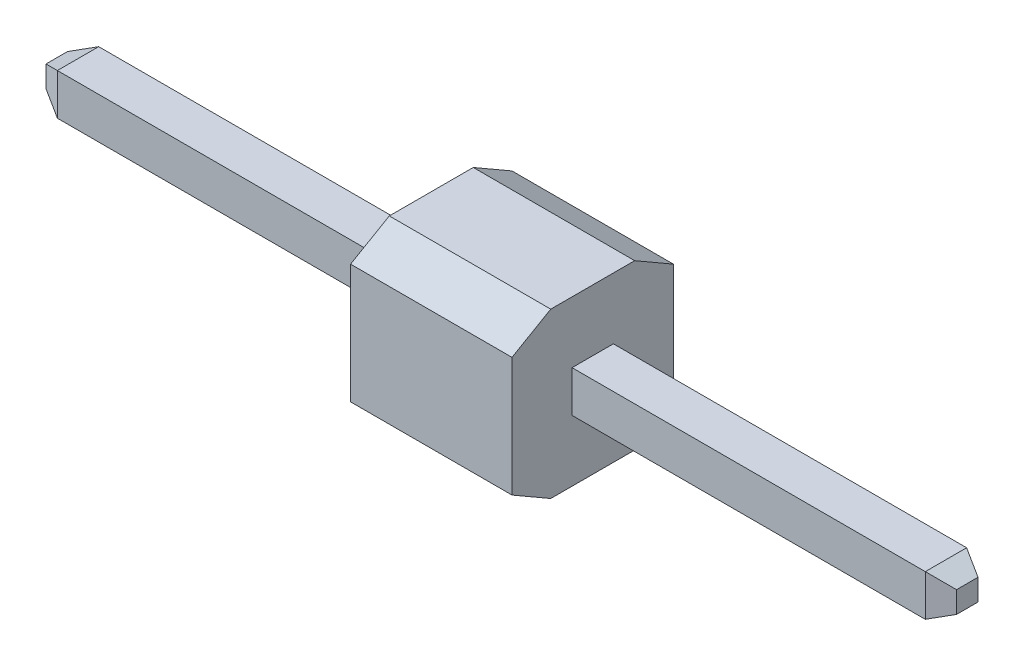
ISO-10303-21;
HEADER;
FILE_DESCRIPTION(('STEP AP214'),'2;1');
FILE_NAME('part.step','',(''),(''),'','','');
FILE_SCHEMA(('AUTOMOTIVE_DESIGN { 1 0 10303 214 1 1 1 1 }'));
ENDSEC;
DATA;
#1=APPLICATION_CONTEXT('core data for automotive mechanical design processes');
#2=APPLICATION_PROTOCOL_DEFINITION('international standard','automotive_design',2000,#1);
#3=PRODUCT_CONTEXT('',#1,'mechanical');
#4=PRODUCT('Part','Part','',(#3));
#5=PRODUCT_RELATED_PRODUCT_CATEGORY('part','',(#4));
#6=PRODUCT_DEFINITION_FORMATION('','',#4);
#7=PRODUCT_DEFINITION_CONTEXT('part definition',#1,'design');
#8=PRODUCT_DEFINITION('design','',#6,#7);
#9=PRODUCT_DEFINITION_SHAPE('','',#8);
#10=(LENGTH_UNIT() NAMED_UNIT(*) SI_UNIT(.MILLI.,.METRE.));
#11=(NAMED_UNIT(*) PLANE_ANGLE_UNIT() SI_UNIT($,.RADIAN.));
#12=(NAMED_UNIT(*) SI_UNIT($,.STERADIAN.) SOLID_ANGLE_UNIT());
#13=UNCERTAINTY_MEASURE_WITH_UNIT(LENGTH_MEASURE(1.E-05),#10,'distance_accuracy_value','');
#14=(GEOMETRIC_REPRESENTATION_CONTEXT(3) GLOBAL_UNCERTAINTY_ASSIGNED_CONTEXT((#13)) GLOBAL_UNIT_ASSIGNED_CONTEXT((#10,
#11,#12)) REPRESENTATION_CONTEXT('',''));
#15=CARTESIAN_POINT('',(0.,0.,0.));
#16=DIRECTION('',(0.,0.,1.));
#17=DIRECTION('',(1.,0.,0.));
#18=AXIS2_PLACEMENT_3D('',#15,#16,#17);
#19=CARTESIAN_POINT('',(5.42105136128053,5.39712144810304,-2.62999869851647));
#20=DIRECTION('',(1.,-9.93476518829084E-08,4.37113882867379E-08));
#21=DIRECTION('',(-9.93476589883358E-08,-1.,8.74227765734759E-08));
#22=AXIS2_PLACEMENT_3D('',#19,#20,#21);
#23=PLANE('',#22);
#24=DIRECTION('',(-1.18186619959584E-08,-0.500000075710541,-0.866025360072933));
#25=VECTOR('',#24,1.);
#26=CARTESIAN_POINT('',(5.42105116910592,4.15353174686681,-1.05999858979839));
#27=LINE('',#26,#25);
#28=CARTESIAN_POINT('',(5.42105116910592,4.15353174686681,-1.05999858979839));
#29=VERTEX_POINT('',#28);
#30=CARTESIAN_POINT('',(5.42105116091771,3.80712153290314,-1.65999855951425));
#31=VERTEX_POINT('',#30);
#32=EDGE_CURVE('E11',#29,#31,#27,.T.);
#33=ORIENTED_EDGE('',*,*,#32,.T.);
#34=DIRECTION('',(4.37113811813104E-08,-8.74227814926175E-08,-0.999999999999995));
#35=VECTOR('',#34,1.);
#36=CARTESIAN_POINT('',(5.42105116091771,3.80712153290314,-1.65999855951425));
#37=LINE('',#36,#35);
#38=CARTESIAN_POINT('',(5.42105121774251,3.80712141925352,-2.95999855951425));
#39=VERTEX_POINT('',#38);
#40=EDGE_CURVE('E304',#31,#39,#37,.T.);
#41=ORIENTED_EDGE('',*,*,#40,.T.);
#42=DIRECTION('',(8.75289950712043E-08,0.499999924289839,-0.866025447495711));
#43=VECTOR('',#42,1.);
#44=CARTESIAN_POINT('',(5.42105121774251,3.80712141925352,-2.95999855951425));
#45=LINE('',#44,#43);
#46=CARTESIAN_POINT('',(5.42105127838437,4.15353152830985,-3.55999858979839));
#47=VERTEX_POINT('',#46);
#48=EDGE_CURVE('E296',#39,#47,#45,.T.);
#49=ORIENTED_EDGE('',*,*,#48,.T.);
#50=DIRECTION('',(9.93476593244772E-08,0.999999999999991,-8.74227764822788E-08));
#51=VECTOR('',#50,1.);
#52=CARTESIAN_POINT('',(5.42105127838437,4.15353152830985,-3.55999858979839));
#53=LINE('',#52,#51);
#54=CARTESIAN_POINT('',(5.42105146189735,6.00071120527985,-3.55999875128397));
#55=VERTEX_POINT('',#54);
#56=EDGE_CURVE('E281',#47,#55,#53,.T.);
#57=ORIENTED_EDGE('',*,*,#56,.T.);
#58=DIRECTION('',(-1.18186632778483E-08,-0.500000075710533,-0.866025360072938));
#59=VECTOR('',#58,1.);
#60=CARTESIAN_POINT('',(5.42105147008556,6.34712141925352,-2.9599987815681));
#61=LINE('',#60,#59);
#62=CARTESIAN_POINT('',(5.42105147008556,6.34712141925352,-2.9599987815681));
#63=VERTEX_POINT('',#62);
#64=EDGE_CURVE('E265',#63,#55,#61,.T.);
#65=ORIENTED_EDGE('',*,*,#64,.F.);
#66=DIRECTION('',(4.37113811813104E-08,-8.74227842254741E-08,-0.999999999999995));
#67=VECTOR('',#66,1.);
#68=CARTESIAN_POINT('',(5.42105141326076,6.34712153290314,-1.6599987815681));
#69=LINE('',#68,#67);
#70=CARTESIAN_POINT('',(5.42105141326076,6.34712153290314,-1.6599987815681));
#71=VERTEX_POINT('',#70);
#72=EDGE_CURVE('E248',#71,#63,#69,.T.);
#73=ORIENTED_EDGE('',*,*,#72,.F.);
#74=DIRECTION('',(8.75289963525477E-08,0.499999924289836,-0.866025447495714));
#75=VECTOR('',#74,1.);
#76=CARTESIAN_POINT('',(5.4210513526189,6.00071142383681,-1.05999875128397));
#77=LINE('',#76,#75);
#78=CARTESIAN_POINT('',(5.4210513526189,6.00071142383681,-1.05999875128397));
#79=VERTEX_POINT('',#78);
#80=EDGE_CURVE('E242',#79,#71,#77,.T.);
#81=ORIENTED_EDGE('',*,*,#80,.F.);
#82=DIRECTION('',(9.93476593244772E-08,0.999999999999991,-8.74227763620714E-08));
#83=VECTOR('',#82,1.);
#84=CARTESIAN_POINT('',(5.42105116910592,4.15353174686681,-1.05999858979839));
#85=LINE('',#84,#83);
#86=EDGE_CURVE('E236',#29,#79,#85,.T.);
#87=ORIENTED_EDGE('',*,*,#86,.F.);
#88=EDGE_LOOP('',(#33,#41,#49,#57,#65,#73,#81,#87));
#89=FACE_BOUND('',#88,.T.);
#90=DIRECTION('',(-4.37113817364219E-08,8.74227856773042E-08,0.999999999999995));
#91=VECTOR('',#90,1.);
#92=CARTESIAN_POINT('',(5.42105129769803,4.75712144810304,-2.62999864256589));
#93=LINE('',#92,#91);
#94=CARTESIAN_POINT('',(5.42105129769803,4.75712144810304,-2.62999864256589));
#95=VERTEX_POINT('',#94);
#96=CARTESIAN_POINT('',(5.42105126972274,4.75712150405362,-1.98999864256589));
#97=VERTEX_POINT('',#96);
#98=EDGE_CURVE('E302',#95,#97,#93,.T.);
#99=ORIENTED_EDGE('',*,*,#98,.T.);
#100=DIRECTION('',(-9.93476592658906E-08,-0.999999999999991,8.74227766567418E-08));
#101=VECTOR('',#100,1.);
#102=CARTESIAN_POINT('',(5.42105133330524,5.39712150405362,-1.98999869851647));
#103=LINE('',#102,#101);
#104=CARTESIAN_POINT('',(5.42105133330524,5.39712150405362,-1.98999869851647));
#105=VERTEX_POINT('',#104);
#106=EDGE_CURVE('E293',#105,#97,#103,.T.);
#107=ORIENTED_EDGE('',*,*,#106,.F.);
#108=DIRECTION('',(-4.37113817364219E-08,8.74227856773042E-08,0.999999999999995));
#109=VECTOR('',#108,1.);
#110=CARTESIAN_POINT('',(5.42105136128053,5.39712144810304,-2.62999869851647));
#111=LINE('',#110,#109);
#112=CARTESIAN_POINT('',(5.42105136128053,5.39712144810304,-2.62999869851647));
#113=VERTEX_POINT('',#112);
#114=EDGE_CURVE('E278',#113,#105,#111,.T.);
#115=ORIENTED_EDGE('',*,*,#114,.F.);
#116=DIRECTION('',(-9.93476592658906E-08,-0.999999999999991,8.74227766567418E-08));
#117=VECTOR('',#116,1.);
#118=CARTESIAN_POINT('',(5.42105136128053,5.39712144810304,-2.62999869851647));
#119=LINE('',#118,#117);
#120=EDGE_CURVE('E263',#113,#95,#119,.T.);
#121=ORIENTED_EDGE('',*,*,#120,.T.);
#122=EDGE_LOOP('',(#99,#107,#115,#121));
#123=FACE_BOUND('',#122,.T.);
#124=ADVANCED_FACE('F17',(#89,#123),#23,.T.);
#125=CARTESIAN_POINT('',(2.92105136128053,5.39712169647217,-2.62999880779494));
#126=DIRECTION('',(1.,-9.93476518829084E-08,4.37113882867379E-08));
#127=DIRECTION('',(-9.93476589883358E-08,-1.,8.74227765734759E-08));
#128=AXIS2_PLACEMENT_3D('',#125,#126,#127);
#129=PLANE('',#128);
#130=DIRECTION('',(-1.1818662636946E-08,-0.500000075710541,-0.866025360072933));
#131=VECTOR('',#130,1.);
#132=CARTESIAN_POINT('',(2.92105116910592,4.15353199523594,-1.05999869907686));
#133=LINE('',#132,#131);
#134=CARTESIAN_POINT('',(2.92105116910592,4.15353199523594,-1.05999869907686));
#135=VERTEX_POINT('',#134);
#136=CARTESIAN_POINT('',(2.92105116091771,3.80712178127227,-1.65999866879272));
#137=VERTEX_POINT('',#136);
#138=EDGE_CURVE('E24',#135,#137,#133,.T.);
#139=ORIENTED_EDGE('',*,*,#138,.F.);
#140=DIRECTION('',(9.93476590840625E-08,0.999999999999991,-8.74227763620714E-08));
#141=VECTOR('',#140,1.);
#142=CARTESIAN_POINT('',(2.92105116910592,4.15353199523594,-1.05999869907686));
#143=LINE('',#142,#141);
#144=CARTESIAN_POINT('',(2.9210513526189,6.00071167220594,-1.05999886056244));
#145=VERTEX_POINT('',#144);
#146=EDGE_CURVE('E300',#135,#145,#143,.T.);
#147=ORIENTED_EDGE('',*,*,#146,.T.);
#148=DIRECTION('',(8.75289963525477E-08,0.499999924289836,-0.866025447495714));
#149=VECTOR('',#148,1.);
#150=CARTESIAN_POINT('',(2.9210513526189,6.00071167220594,-1.05999886056244));
#151=LINE('',#150,#149);
#152=CARTESIAN_POINT('',(2.92105141326076,6.34712178127227,-1.65999889084657));
#153=VERTEX_POINT('',#152);
#154=EDGE_CURVE('E286',#145,#153,#151,.T.);
#155=ORIENTED_EDGE('',*,*,#154,.T.);
#156=DIRECTION('',(4.37113811813104E-08,-8.74227842254741E-08,-0.999999999999995));
#157=VECTOR('',#156,1.);
#158=CARTESIAN_POINT('',(2.92105141326076,6.34712178127227,-1.65999889084657));
#159=LINE('',#158,#157);
#160=CARTESIAN_POINT('',(2.92105147008556,6.34712166762265,-2.95999889084657));
#161=VERTEX_POINT('',#160);
#162=EDGE_CURVE('E271',#153,#161,#159,.T.);
#163=ORIENTED_EDGE('',*,*,#162,.T.);
#164=DIRECTION('',(-1.18186632778483E-08,-0.500000075710533,-0.866025360072938));
#165=VECTOR('',#164,1.);
#166=CARTESIAN_POINT('',(2.92105147008556,6.34712166762265,-2.95999889084657));
#167=LINE('',#166,#165);
#168=CARTESIAN_POINT('',(2.92105146189735,6.00071145364898,-3.55999886056244));
#169=VERTEX_POINT('',#168);
#170=EDGE_CURVE('E253',#161,#169,#167,.T.);
#171=ORIENTED_EDGE('',*,*,#170,.T.);
#172=DIRECTION('',(9.93476590840625E-08,0.999999999999991,-8.74227764822788E-08));
#173=VECTOR('',#172,1.);
#174=CARTESIAN_POINT('',(2.92105127838437,4.15353177667898,-3.55999869907686));
#175=LINE('',#174,#173);
#176=CARTESIAN_POINT('',(2.92105127838437,4.15353177667898,-3.55999869907686));
#177=VERTEX_POINT('',#176);
#178=EDGE_CURVE('E261',#177,#169,#175,.T.);
#179=ORIENTED_EDGE('',*,*,#178,.F.);
#180=DIRECTION('',(8.75289957121919E-08,0.499999924289839,-0.866025447495711));
#181=VECTOR('',#180,1.);
#182=CARTESIAN_POINT('',(2.92105121774251,3.80712166762265,-2.95999866879272));
#183=LINE('',#182,#181);
#184=CARTESIAN_POINT('',(2.92105121774251,3.80712166762265,-2.95999866879272));
#185=VERTEX_POINT('',#184);
#186=EDGE_CURVE('E276',#185,#177,#183,.T.);
#187=ORIENTED_EDGE('',*,*,#186,.F.);
#188=DIRECTION('',(4.37113811813104E-08,-8.74227814926175E-08,-0.999999999999995));
#189=VECTOR('',#188,1.);
#190=CARTESIAN_POINT('',(2.92105116091771,3.80712178127227,-1.65999866879272));
#191=LINE('',#190,#189);
#192=EDGE_CURVE('E291',#137,#185,#191,.T.);
#193=ORIENTED_EDGE('',*,*,#192,.F.);
#194=EDGE_LOOP('',(#139,#147,#155,#163,#171,#179,#187,#193));
#195=FACE_BOUND('',#194,.T.);
#196=DIRECTION('',(-9.93476592658906E-08,-0.999999999999991,8.74227766567418E-08));
#197=VECTOR('',#196,1.);
#198=CARTESIAN_POINT('',(2.92105133330524,5.39712175242275,-1.98999880779494));
#199=LINE('',#198,#197);
#200=CARTESIAN_POINT('',(2.92105133330524,5.39712175242275,-1.98999880779494));
#201=VERTEX_POINT('',#200);
#202=CARTESIAN_POINT('',(2.92105126972274,4.75712175242275,-1.98999875184436));
#203=VERTEX_POINT('',#202);
#204=EDGE_CURVE('E298',#201,#203,#199,.T.);
#205=ORIENTED_EDGE('',*,*,#204,.T.);
#206=DIRECTION('',(-4.37113817364219E-08,8.74227856773042E-08,0.999999999999995));
#207=VECTOR('',#206,1.);
#208=CARTESIAN_POINT('',(2.92105129769803,4.75712169647217,-2.62999875184436));
#209=LINE('',#208,#207);
#210=CARTESIAN_POINT('',(2.92105129769803,4.75712169647217,-2.62999875184436));
#211=VERTEX_POINT('',#210);
#212=EDGE_CURVE('E283',#211,#203,#209,.T.);
#213=ORIENTED_EDGE('',*,*,#212,.F.);
#214=DIRECTION('',(-9.93476585720012E-08,-0.999999999999991,8.74227766567418E-08));
#215=VECTOR('',#214,1.);
#216=CARTESIAN_POINT('',(2.92105136128053,5.39712169647217,-2.62999880779494));
#217=LINE('',#216,#215);
#218=CARTESIAN_POINT('',(2.92105136128053,5.39712169647217,-2.62999880779494));
#219=VERTEX_POINT('',#218);
#220=EDGE_CURVE('E268',#219,#211,#217,.T.);
#221=ORIENTED_EDGE('',*,*,#220,.F.);
#222=DIRECTION('',(-4.37113810425325E-08,8.74227856773042E-08,0.999999999999995));
#223=VECTOR('',#222,1.);
#224=CARTESIAN_POINT('',(2.92105136128053,5.39712169647217,-2.62999880779494));
#225=LINE('',#224,#223);
#226=EDGE_CURVE('E251',#219,#201,#225,.T.);
#227=ORIENTED_EDGE('',*,*,#226,.T.);
#228=EDGE_LOOP('',(#205,#213,#221,#227));
#229=FACE_BOUND('',#228,.T.);
#230=ADVANCED_FACE('F314',(#195,#229),#129,.F.);
#231=CARTESIAN_POINT('',(5.42105116910592,4.15353174686681,-1.05999858979839));
#232=DIRECTION('',(1.07893287081065E-07,0.866025360072937,-0.500000075710535));
#233=DIRECTION('',(1.18186629566715E-08,0.500000075710542,0.866025360072941));
#234=AXIS2_PLACEMENT_3D('',#231,#232,#233);
#235=PLANE('',#234);
#236=ORIENTED_EDGE('',*,*,#138,.T.);
#237=DIRECTION('',(-0.999999999999994,9.93476504618223E-08,-4.37113883755555E-08));
#238=VECTOR('',#237,1.);
#239=CARTESIAN_POINT('',(5.42105116091771,3.80712153290314,-1.65999855951425));
#240=LINE('',#239,#238);
#241=EDGE_CURVE('E288',#31,#137,#240,.T.);
#242=ORIENTED_EDGE('',*,*,#241,.F.);
#243=ORIENTED_EDGE('',*,*,#32,.F.);
#244=DIRECTION('',(-0.999999999999994,9.93476504618224E-08,-4.3711388109102E-08));
#245=VECTOR('',#244,1.);
#246=CARTESIAN_POINT('',(5.42105116910592,4.15353174686681,-1.05999858979839));
#247=LINE('',#246,#245);
#248=EDGE_CURVE('E256',#29,#135,#247,.T.);
#249=ORIENTED_EDGE('',*,*,#248,.T.);
#250=EDGE_LOOP('',(#236,#242,#243,#249));
#251=FACE_BOUND('',#250,.T.);
#252=ADVANCED_FACE('F306',(#251),#235,.F.);
#253=CARTESIAN_POINT('',(5.42105116091771,3.80712153290314,-1.65999855951425));
#254=DIRECTION('',(9.93476589883358E-08,1.,-8.74227765734759E-08));
#255=DIRECTION('',(1.,-9.93476518829084E-08,4.37113882867379E-08));
#256=AXIS2_PLACEMENT_3D('',#253,#254,#255);
#257=PLANE('',#256);
#258=ORIENTED_EDGE('',*,*,#192,.T.);
#259=DIRECTION('',(-0.999999999999994,9.93476504618223E-08,-4.37113882867377E-08));
#260=VECTOR('',#259,1.);
#261=CARTESIAN_POINT('',(5.42105121774251,3.80712141925352,-2.95999855951425));
#262=LINE('',#261,#260);
#263=EDGE_CURVE('E273',#39,#185,#262,.T.);
#264=ORIENTED_EDGE('',*,*,#263,.F.);
#265=ORIENTED_EDGE('',*,*,#40,.F.);
#266=ORIENTED_EDGE('',*,*,#241,.T.);
#267=EDGE_LOOP('',(#258,#264,#265,#266));
#268=FACE_BOUND('',#267,.T.);
#269=ADVANCED_FACE('F311',(#268),#257,.F.);
#270=CARTESIAN_POINT('',(5.42105121774251,3.80712141925352,-2.95999855951425));
#271=DIRECTION('',(6.41819058997377E-08,0.866025447495721,0.499999924289845));
#272=DIRECTION('',(-8.7528996031702E-08,-0.499999924289838,0.866025447495717));
#273=AXIS2_PLACEMENT_3D('',#270,#271,#272);
#274=PLANE('',#273);
#275=ORIENTED_EDGE('',*,*,#186,.T.);
#276=DIRECTION('',(-0.999999999999994,9.93476504618224E-08,-4.37113882867377E-08));
#277=VECTOR('',#276,1.);
#278=CARTESIAN_POINT('',(5.42105127838437,4.15353152830985,-3.55999858979839));
#279=LINE('',#278,#277);
#280=EDGE_CURVE('E258',#47,#177,#279,.T.);
#281=ORIENTED_EDGE('',*,*,#280,.F.);
#282=ORIENTED_EDGE('',*,*,#48,.F.);
#283=ORIENTED_EDGE('',*,*,#263,.T.);
#284=EDGE_LOOP('',(#275,#281,#282,#283));
#285=FACE_BOUND('',#284,.T.);
#286=ADVANCED_FACE('F319',(#285),#274,.F.);
#287=CARTESIAN_POINT('',(5.42105127838437,4.15353152830985,-3.55999858979839));
#288=DIRECTION('',(-4.37113811813106E-08,8.74227836789032E-08,1.));
#289=DIRECTION('',(-1.,9.93476518829084E-08,-4.37113882867379E-08));
#290=AXIS2_PLACEMENT_3D('',#287,#288,#289);
#291=PLANE('',#290);
#292=ORIENTED_EDGE('',*,*,#178,.T.);
#293=DIRECTION('',(-0.999999999999994,9.93476504618223E-08,-4.37113882867377E-08));
#294=VECTOR('',#293,1.);
#295=CARTESIAN_POINT('',(5.42105146189735,6.00071120527985,-3.55999875128397));
#296=LINE('',#295,#294);
#297=EDGE_CURVE('E245',#55,#169,#296,.T.);
#298=ORIENTED_EDGE('',*,*,#297,.F.);
#299=ORIENTED_EDGE('',*,*,#56,.F.);
#300=ORIENTED_EDGE('',*,*,#280,.T.);
#301=EDGE_LOOP('',(#292,#298,#299,#300));
#302=FACE_BOUND('',#301,.T.);
#303=ADVANCED_FACE('F326',(#302),#291,.F.);
#304=CARTESIAN_POINT('',(5.42105147008556,6.34712141925352,-2.9599987815681));
#305=DIRECTION('',(1.07893287081065E-07,0.866025360072937,-0.500000075710535));
#306=DIRECTION('',(1.18186629566715E-08,0.500000075710542,0.866025360072941));
#307=AXIS2_PLACEMENT_3D('',#304,#305,#306);
#308=PLANE('',#307);
#309=ORIENTED_EDGE('',*,*,#170,.F.);
#310=DIRECTION('',(-0.999999999999994,9.93476533039933E-08,-4.37113882867377E-08));
#311=VECTOR('',#310,1.);
#312=CARTESIAN_POINT('',(5.42105147008556,6.34712141925352,-2.9599987815681));
#313=LINE('',#312,#311);
#314=EDGE_CURVE('E239',#63,#161,#313,.T.);
#315=ORIENTED_EDGE('',*,*,#314,.F.);
#316=ORIENTED_EDGE('',*,*,#64,.T.);
#317=ORIENTED_EDGE('',*,*,#297,.T.);
#318=EDGE_LOOP('',(#309,#315,#316,#317));
#319=FACE_BOUND('',#318,.T.);
#320=ADVANCED_FACE('F329',(#319),#308,.T.);
#321=CARTESIAN_POINT('',(5.42105141326076,6.34712153290314,-1.6599987815681));
#322=DIRECTION('',(9.93476589883358E-08,1.,-8.74227765734759E-08));
#323=DIRECTION('',(1.,-9.93476518829084E-08,4.37113882867379E-08));
#324=AXIS2_PLACEMENT_3D('',#321,#322,#323);
#325=PLANE('',#324);
#326=ORIENTED_EDGE('',*,*,#162,.F.);
#327=DIRECTION('',(-0.999999999999994,9.93476533039933E-08,-4.37113882867377E-08));
#328=VECTOR('',#327,1.);
#329=CARTESIAN_POINT('',(5.42105141326076,6.34712153290314,-1.6599987815681));
#330=LINE('',#329,#328);
#331=EDGE_CURVE('E233',#71,#153,#330,.T.);
#332=ORIENTED_EDGE('',*,*,#331,.F.);
#333=ORIENTED_EDGE('',*,*,#72,.T.);
#334=ORIENTED_EDGE('',*,*,#314,.T.);
#335=EDGE_LOOP('',(#326,#332,#333,#334));
#336=FACE_BOUND('',#335,.T.);
#337=ADVANCED_FACE('F333',(#336),#325,.T.);
#338=CARTESIAN_POINT('',(5.4210513526189,6.00071142383681,-1.05999875128397));
#339=DIRECTION('',(6.41819058997377E-08,0.866025447495721,0.499999924289845));
#340=DIRECTION('',(-8.7528996031702E-08,-0.499999924289838,0.866025447495717));
#341=AXIS2_PLACEMENT_3D('',#338,#339,#340);
#342=PLANE('',#341);
#343=ORIENTED_EDGE('',*,*,#154,.F.);
#344=DIRECTION('',(-0.999999999999994,9.93476504618223E-08,-4.3711388109102E-08));
#345=VECTOR('',#344,1.);
#346=CARTESIAN_POINT('',(5.4210513526189,6.00071142383681,-1.05999875128397));
#347=LINE('',#346,#345);
#348=EDGE_CURVE('E230',#79,#145,#347,.T.);
#349=ORIENTED_EDGE('',*,*,#348,.F.);
#350=ORIENTED_EDGE('',*,*,#80,.T.);
#351=ORIENTED_EDGE('',*,*,#331,.T.);
#352=EDGE_LOOP('',(#343,#349,#350,#351));
#353=FACE_BOUND('',#352,.T.);
#354=ADVANCED_FACE('F337',(#353),#342,.T.);
#355=CARTESIAN_POINT('',(5.42105116910592,4.15353174686681,-1.05999858979839));
#356=DIRECTION('',(-4.37113811813106E-08,8.74227835615132E-08,1.));
#357=DIRECTION('',(-9.93476589883358E-08,-1.,8.74227764560859E-08));
#358=AXIS2_PLACEMENT_3D('',#355,#356,#357);
#359=PLANE('',#358);
#360=ORIENTED_EDGE('',*,*,#146,.F.);
#361=ORIENTED_EDGE('',*,*,#248,.F.);
#362=ORIENTED_EDGE('',*,*,#86,.T.);
#363=ORIENTED_EDGE('',*,*,#348,.T.);
#364=EDGE_LOOP('',(#360,#361,#362,#363));
#365=FACE_BOUND('',#364,.T.);
#366=ADVANCED_FACE('F339',(#365),#359,.T.);
#367=CARTESIAN_POINT('',(-2.87894863871947,5.39712227268855,-2.62999906132099));
#368=DIRECTION('',(-1.,9.93476518829084E-08,-4.37113882867379E-08));
#369=DIRECTION('',(9.93476589883358E-08,1.,-8.74227765734759E-08));
#370=AXIS2_PLACEMENT_3D('',#367,#368,#369);
#371=PLANE('',#370);
#372=DIRECTION('',(9.93476581477908E-08,0.999999999999991,-8.74227761415111E-08));
#373=VECTOR('',#372,1.);
#374=CARTESIAN_POINT('',(-2.87894870826311,4.91100384237638,-2.14388054601416));
#375=LINE('',#374,#373);
#376=CARTESIAN_POINT('',(-2.87894870826312,4.91100384237638,-2.14388054601416));
#377=VERTEX_POINT('',#376);
#378=CARTESIAN_POINT('',(-2.87894867525615,5.24324078798638,-2.14388057505924));
#379=VERTEX_POINT('',#378);
#380=EDGE_CURVE('E228',#377,#379,#375,.T.);
#381=ORIENTED_EDGE('',*,*,#380,.T.);
#382=DIRECTION('',(4.37113793813866E-08,-8.74227854960559E-08,-0.999999999999995));
#383=VECTOR('',#382,1.);
#384=CARTESIAN_POINT('',(-2.87894867525615,5.24324078798638,-2.14388057505924));
#385=LINE('',#384,#383);
#386=CARTESIAN_POINT('',(-2.87894866073362,5.2432407589413,-2.47611752067724));
#387=VERTEX_POINT('',#386);
#388=EDGE_CURVE('E223',#379,#387,#385,.T.);
#389=ORIENTED_EDGE('',*,*,#388,.T.);
#390=DIRECTION('',(-9.93476608211191E-08,-0.999999999999991,8.74227774781752E-08));
#391=VECTOR('',#390,1.);
#392=CARTESIAN_POINT('',(-2.87894866073362,5.2432407589413,-2.47611752067724));
#393=LINE('',#392,#391);
#394=CARTESIAN_POINT('',(-2.87894869374058,4.9110038133313,-2.47611749163216));
#395=VERTEX_POINT('',#394);
#396=EDGE_CURVE('E215',#387,#395,#393,.T.);
#397=ORIENTED_EDGE('',*,*,#396,.T.);
#398=DIRECTION('',(-4.37113767080584E-08,8.74227854960561E-08,0.999999999999995));
#399=VECTOR('',#398,1.);
#400=CARTESIAN_POINT('',(-2.87894869374058,4.9110038133313,-2.47611749163216));
#401=LINE('',#400,#399);
#402=EDGE_CURVE('E207',#395,#377,#401,.T.);
#403=ORIENTED_EDGE('',*,*,#402,.T.);
#404=EDGE_LOOP('',(#381,#389,#397,#403));
#405=FACE_BOUND('',#404,.T.);
#406=ADVANCED_FACE('F341',(#405),#371,.T.);
#407=CARTESIAN_POINT('',(-2.87894863871947,5.39712227268855,-2.62999906132099));
#408=DIRECTION('',(9.93476589883358E-08,1.,-8.74227764510112E-08));
#409=DIRECTION('',(-4.37113811813106E-08,8.74227835564385E-08,1.));
#410=AXIS2_PLACEMENT_3D('',#407,#408,#409);
#411=PLANE('',#410);
#412=DIRECTION('',(0.999999999999994,-9.93476521037346E-08,4.37113882769953E-08));
#413=VECTOR('',#412,1.);
#414=CARTESIAN_POINT('',(-2.54894863871947,5.39712223990383,-2.62999904689623));
#415=LINE('',#414,#413);
#416=CARTESIAN_POINT('',(-2.54894863871947,5.39712223990383,-2.62999904689623));
#417=VERTEX_POINT('',#416);
#418=EDGE_CURVE('E225',#417,#219,#415,.T.);
#419=ORIENTED_EDGE('',*,*,#418,.F.);
#420=DIRECTION('',(-4.37113817364219E-08,8.74227856773042E-08,0.999999999999995));
#421=VECTOR('',#420,1.);
#422=CARTESIAN_POINT('',(-2.54894863871947,5.39712223990383,-2.62999904689623));
#423=LINE('',#422,#421);
#424=CARTESIAN_POINT('',(-2.54894866669476,5.39712229585441,-1.98999904689623));
#425=VERTEX_POINT('',#424);
#426=EDGE_CURVE('E217',#417,#425,#423,.T.);
#427=ORIENTED_EDGE('',*,*,#426,.T.);
#428=DIRECTION('',(0.999999999999994,-9.93476521037346E-08,4.3711388195809E-08));
#429=VECTOR('',#428,1.);
#430=CARTESIAN_POINT('',(-2.54894866669476,5.39712229585441,-1.98999904689623));
#431=LINE('',#430,#429);
#432=EDGE_CURVE('E220',#425,#201,#431,.T.);
#433=ORIENTED_EDGE('',*,*,#432,.T.);
#434=ORIENTED_EDGE('',*,*,#226,.F.);
#435=EDGE_LOOP('',(#419,#427,#433,#434));
#436=FACE_BOUND('',#435,.T.);
#437=ADVANCED_FACE('F348',(#436),#411,.T.);
#438=CARTESIAN_POINT('',(-2.87894866669476,5.39712232863913,-1.98999906132099));
#439=DIRECTION('',(-4.37113811813106E-08,8.74227836789032E-08,1.));
#440=DIRECTION('',(-1.,9.93476518829084E-08,-4.37113882867379E-08));
#441=AXIS2_PLACEMENT_3D('',#438,#439,#440);
#442=PLANE('',#441);
#443=ORIENTED_EDGE('',*,*,#432,.F.);
#444=DIRECTION('',(-9.93476592658906E-08,-0.999999999999991,8.74227766567418E-08));
#445=VECTOR('',#444,1.);
#446=CARTESIAN_POINT('',(-2.54894866669476,5.39712229585441,-1.98999904689623));
#447=LINE('',#446,#445);
#448=CARTESIAN_POINT('',(-2.54894873027726,4.75712229585441,-1.98999899094565));
#449=VERTEX_POINT('',#448);
#450=EDGE_CURVE('E209',#425,#449,#447,.T.);
#451=ORIENTED_EDGE('',*,*,#450,.T.);
#452=DIRECTION('',(0.999999999999994,-9.93476521037346E-08,4.3711388195809E-08));
#453=VECTOR('',#452,1.);
#454=CARTESIAN_POINT('',(-2.54894873027726,4.75712229585441,-1.98999899094565));
#455=LINE('',#454,#453);
#456=EDGE_CURVE('E212',#449,#203,#455,.T.);
#457=ORIENTED_EDGE('',*,*,#456,.T.);
#458=ORIENTED_EDGE('',*,*,#204,.F.);
#459=EDGE_LOOP('',(#443,#451,#457,#458));
#460=FACE_BOUND('',#459,.T.);
#461=ADVANCED_FACE('F424',(#460),#442,.T.);
#462=CARTESIAN_POINT('',(-2.87894870230197,4.75712227268855,-2.62999900537041));
#463=DIRECTION('',(9.93476589883357E-08,1.,-8.74227764040693E-08));
#464=DIRECTION('',(-4.37113811813106E-08,8.74227835094966E-08,1.));
#465=AXIS2_PLACEMENT_3D('',#462,#463,#464);
#466=PLANE('',#465);
#467=ORIENTED_EDGE('',*,*,#456,.F.);
#468=DIRECTION('',(4.37113831242006E-08,-8.74227912284193E-08,-0.999999999999995));
#469=VECTOR('',#468,1.);
#470=CARTESIAN_POINT('',(-2.54894873027726,4.75712229585441,-1.98999899094565));
#471=LINE('',#470,#469);
#472=CARTESIAN_POINT('',(-2.54894870230197,4.75712223990383,-2.62999899094565));
#473=VERTEX_POINT('',#472);
#474=EDGE_CURVE('E201',#449,#473,#471,.T.);
#475=ORIENTED_EDGE('',*,*,#474,.T.);
#476=DIRECTION('',(0.999999999999994,-9.93476521037346E-08,4.37113882769953E-08));
#477=VECTOR('',#476,1.);
#478=CARTESIAN_POINT('',(-2.54894870230197,4.75712223990383,-2.62999899094565));
#479=LINE('',#478,#477);
#480=EDGE_CURVE('E204',#473,#211,#479,.T.);
#481=ORIENTED_EDGE('',*,*,#480,.T.);
#482=ORIENTED_EDGE('',*,*,#212,.T.);
#483=EDGE_LOOP('',(#467,#475,#481,#482));
#484=FACE_BOUND('',#483,.T.);
#485=ADVANCED_FACE('F421',(#484),#466,.F.);
#486=CARTESIAN_POINT('',(-2.87894863871947,5.39712227268855,-2.62999906132099));
#487=DIRECTION('',(-4.37113811813106E-08,8.74227836789032E-08,1.));
#488=DIRECTION('',(-1.,9.93476518829084E-08,-4.37113882867379E-08));
#489=AXIS2_PLACEMENT_3D('',#486,#487,#488);
#490=PLANE('',#489);
#491=ORIENTED_EDGE('',*,*,#480,.F.);
#492=DIRECTION('',(9.93476578781118E-08,0.999999999999991,-8.74227766567418E-08));
#493=VECTOR('',#492,1.);
#494=CARTESIAN_POINT('',(-2.54894870230197,4.75712223990383,-2.62999899094565));
#495=LINE('',#494,#493);
#496=EDGE_CURVE('E196',#473,#417,#495,.T.);
#497=ORIENTED_EDGE('',*,*,#496,.T.);
#498=ORIENTED_EDGE('',*,*,#418,.T.);
#499=ORIENTED_EDGE('',*,*,#220,.T.);
#500=EDGE_LOOP('',(#491,#497,#498,#499));
#501=FACE_BOUND('',#500,.T.);
#502=ADVANCED_FACE('F376',(#501),#490,.F.);
#503=CARTESIAN_POINT('',(-2.87894863871947,5.39712227268855,-2.62999906132099));
#504=DIRECTION('',(-4.37113811813106E-08,8.74227836789032E-08,1.));
#505=DIRECTION('',(-1.,9.93476518829084E-08,-4.37113882867379E-08));
#506=AXIS2_PLACEMENT_3D('',#503,#504,#505);
#507=PLANE('',#506);
#508=DIRECTION('',(0.999999999999994,-9.93476521037346E-08,4.37113882769953E-08));
#509=VECTOR('',#508,1.);
#510=CARTESIAN_POINT('',(5.42105136128053,5.39712144810304,-2.62999869851647));
#511=LINE('',#510,#509);
#512=CARTESIAN_POINT('',(10.8910513612805,5.39712090467138,-2.62999845941517));
#513=VERTEX_POINT('',#512);
#514=EDGE_CURVE('E199',#113,#513,#511,.T.);
#515=ORIENTED_EDGE('',*,*,#514,.T.);
#516=DIRECTION('',(-9.93476634292269E-08,-0.999999999999991,8.74227766567418E-08));
#517=VECTOR('',#516,1.);
#518=CARTESIAN_POINT('',(10.8910513612805,5.39712090467138,-2.62999845941517));
#519=LINE('',#518,#517);
#520=CARTESIAN_POINT('',(10.891051297698,4.75712090467138,-2.62999840346459));
#521=VERTEX_POINT('',#520);
#522=EDGE_CURVE('E191',#513,#521,#519,.T.);
#523=ORIENTED_EDGE('',*,*,#522,.T.);
#524=DIRECTION('',(0.999999999999994,-9.93476572996596E-08,4.37113882769953E-08));
#525=VECTOR('',#524,1.);
#526=CARTESIAN_POINT('',(5.42105129769803,4.75712144810305,-2.62999864256589));
#527=LINE('',#526,#525);
#528=EDGE_CURVE('E194',#95,#521,#527,.T.);
#529=ORIENTED_EDGE('',*,*,#528,.F.);
#530=ORIENTED_EDGE('',*,*,#120,.F.);
#531=EDGE_LOOP('',(#515,#523,#529,#530));
#532=FACE_BOUND('',#531,.T.);
#533=ADVANCED_FACE('F367',(#532),#507,.F.);
#534=CARTESIAN_POINT('',(-2.87894870230197,4.75712227268855,-2.62999900537041));
#535=DIRECTION('',(9.93476589883357E-08,1.,-8.74227764040693E-08));
#536=DIRECTION('',(-4.37113811813106E-08,8.74227835094966E-08,1.));
#537=AXIS2_PLACEMENT_3D('',#534,#535,#536);
#538=PLANE('',#537);
#539=ORIENTED_EDGE('',*,*,#528,.T.);
#540=DIRECTION('',(-4.37113817364219E-08,8.74227856773042E-08,0.999999999999995));
#541=VECTOR('',#540,1.);
#542=CARTESIAN_POINT('',(10.891051297698,4.75712090467138,-2.62999840346459));
#543=LINE('',#542,#541);
#544=CARTESIAN_POINT('',(10.8910512697227,4.75712096062196,-1.98999840346459));
#545=VERTEX_POINT('',#544);
#546=EDGE_CURVE('E186',#521,#545,#543,.T.);
#547=ORIENTED_EDGE('',*,*,#546,.T.);
#548=DIRECTION('',(0.999999999999994,-9.93476572996596E-08,4.37113881146227E-08));
#549=VECTOR('',#548,1.);
#550=CARTESIAN_POINT('',(5.42105126972274,4.75712150405364,-1.98999864256589));
#551=LINE('',#550,#549);
#552=EDGE_CURVE('E189',#97,#545,#551,.T.);
#553=ORIENTED_EDGE('',*,*,#552,.F.);
#554=ORIENTED_EDGE('',*,*,#98,.F.);
#555=EDGE_LOOP('',(#539,#547,#553,#554));
#556=FACE_BOUND('',#555,.T.);
#557=ADVANCED_FACE('F364',(#556),#538,.F.);
#558=CARTESIAN_POINT('',(-2.87894866669476,5.39712232863913,-1.98999906132099));
#559=DIRECTION('',(-4.37113811813106E-08,8.74227836789032E-08,1.));
#560=DIRECTION('',(-1.,9.93476518829084E-08,-4.37113882867379E-08));
#561=AXIS2_PLACEMENT_3D('',#558,#559,#560);
#562=PLANE('',#561);
#563=ORIENTED_EDGE('',*,*,#552,.T.);
#564=DIRECTION('',(9.93476578781118E-08,0.999999999999991,-8.74227763097971E-08));
#565=VECTOR('',#564,1.);
#566=CARTESIAN_POINT('',(10.8910512697227,4.75712096062196,-1.98999840346459));
#567=LINE('',#566,#565);
#568=CARTESIAN_POINT('',(10.8910513333052,5.39712096062197,-1.98999845941517));
#569=VERTEX_POINT('',#568);
#570=EDGE_CURVE('E176',#545,#569,#567,.T.);
#571=ORIENTED_EDGE('',*,*,#570,.T.);
#572=DIRECTION('',(0.999999999999994,-9.93476521037346E-08,4.37113881146227E-08));
#573=VECTOR('',#572,1.);
#574=CARTESIAN_POINT('',(5.42105133330524,5.39712150405362,-1.98999869851647));
#575=LINE('',#574,#573);
#576=EDGE_CURVE('E179',#105,#569,#575,.T.);
#577=ORIENTED_EDGE('',*,*,#576,.F.);
#578=ORIENTED_EDGE('',*,*,#106,.T.);
#579=EDGE_LOOP('',(#563,#571,#577,#578));
#580=FACE_BOUND('',#579,.T.);
#581=ADVANCED_FACE('F366',(#580),#562,.T.);
#582=CARTESIAN_POINT('',(-2.87894863871947,5.39712227268855,-2.62999906132099));
#583=DIRECTION('',(9.93476589883358E-08,1.,-8.74227764510112E-08));
#584=DIRECTION('',(-4.37113811813106E-08,8.74227835564385E-08,1.));
#585=AXIS2_PLACEMENT_3D('',#582,#583,#584);
#586=PLANE('',#585);
#587=ORIENTED_EDGE('',*,*,#576,.T.);
#588=DIRECTION('',(4.37113817364219E-08,-8.74227912284193E-08,-0.999999999999995));
#589=VECTOR('',#588,1.);
#590=CARTESIAN_POINT('',(10.8910513333052,5.39712096062197,-1.98999845941517));
#591=LINE('',#590,#589);
#592=EDGE_CURVE('E167',#569,#513,#591,.T.);
#593=ORIENTED_EDGE('',*,*,#592,.T.);
#594=ORIENTED_EDGE('',*,*,#514,.F.);
#595=ORIENTED_EDGE('',*,*,#114,.T.);
#596=EDGE_LOOP('',(#587,#593,#594,#595));
#597=FACE_BOUND('',#596,.T.);
#598=ADVANCED_FACE('F373',(#597),#586,.T.);
#599=CARTESIAN_POINT('',(11.2210513612805,5.39712087188666,-2.62999844499041));
#600=DIRECTION('',(-1.,9.93476518829084E-08,-4.37113882867379E-08));
#601=DIRECTION('',(9.93476589883358E-08,1.,-8.74227765734759E-08));
#602=AXIS2_PLACEMENT_3D('',#599,#600,#601);
#603=PLANE('',#602);
#604=DIRECTION('',(-9.93476581477908E-08,-0.999999999999991,8.74227774781752E-08));
#605=VECTOR('',#604,1.);
#606=CARTESIAN_POINT('',(11.2210513247438,5.24323938718449,-2.14387995872866));
#607=LINE('',#606,#605);
#608=CARTESIAN_POINT('',(11.2210513247438,5.24323938718449,-2.14387995872866));
#609=VERTEX_POINT('',#608);
#610=CARTESIAN_POINT('',(11.2210512917369,4.91100244157449,-2.14387992968359));
#611=VERTEX_POINT('',#610);
#612=EDGE_CURVE('E153',#609,#611,#607,.T.);
#613=ORIENTED_EDGE('',*,*,#612,.T.);
#614=DIRECTION('',(4.37113820547149E-08,-8.74227854960559E-08,-0.999999999999995));
#615=VECTOR('',#614,1.);
#616=CARTESIAN_POINT('',(11.2210512917369,4.91100244157449,-2.14387992968359));
#617=LINE('',#616,#615);
#618=CARTESIAN_POINT('',(11.2210513062594,4.91100241252941,-2.47611687530159));
#619=VERTEX_POINT('',#618);
#620=EDGE_CURVE('E395',#611,#619,#617,.T.);
#621=ORIENTED_EDGE('',*,*,#620,.T.);
#622=DIRECTION('',(9.93476581477908E-08,0.999999999999991,-8.74227761415111E-08));
#623=VECTOR('',#622,1.);
#624=CARTESIAN_POINT('',(11.2210513062594,4.91100241252941,-2.47611687530159));
#625=LINE('',#624,#623);
#626=CARTESIAN_POINT('',(11.2210513392664,5.24323935813941,-2.47611690434666));
#627=VERTEX_POINT('',#626);
#628=EDGE_CURVE('E156',#619,#627,#625,.T.);
#629=ORIENTED_EDGE('',*,*,#628,.T.);
#630=DIRECTION('',(-4.37113874013715E-08,8.7422774802743E-08,0.999999999999995));
#631=VECTOR('',#630,1.);
#632=CARTESIAN_POINT('',(11.2210513392664,5.24323935813941,-2.47611690434666));
#633=LINE('',#632,#631);
#634=EDGE_CURVE('E149',#627,#609,#633,.T.);
#635=ORIENTED_EDGE('',*,*,#634,.T.);
#636=EDGE_LOOP('',(#613,#621,#629,#635));
#637=FACE_BOUND('',#636,.T.);
#638=ADVANCED_FACE('F151',(#637),#603,.F.);
#639=CARTESIAN_POINT('',(-2.87894868701421,4.91100379987855,-2.62999901882316));
#640=DIRECTION('',(-0.422618351780369,-0.906307745050466,6.07587120833484E-08));
#641=DIRECTION('',(4.37113811813106E-08,-8.74227835094966E-08,-1.));
#642=AXIS2_PLACEMENT_3D('',#639,#640,#641);
#643=PLANE('',#642);
#644=DIRECTION('',(0.834817073788752,-0.389281669540033,0.389281691158098));
#645=VECTOR('',#644,1.);
#646=CARTESIAN_POINT('',(-2.87894870826313,4.91100384237586,-2.14388054601464));
#647=LINE('',#646,#645);
#648=EDGE_CURVE('E181',#377,#449,#647,.T.);
#649=ORIENTED_EDGE('',*,*,#648,.F.);
#650=ORIENTED_EDGE('',*,*,#402,.F.);
#651=DIRECTION('',(-0.834817107820823,0.389281737604207,0.389281550111904));
#652=VECTOR('',#651,1.);
#653=CARTESIAN_POINT('',(-2.54894870230241,4.75712223990236,-2.62999899094511));
#654=LINE('',#653,#652);
#655=EDGE_CURVE('E404',#473,#395,#654,.T.);
#656=ORIENTED_EDGE('',*,*,#655,.F.);
#657=ORIENTED_EDGE('',*,*,#474,.F.);
#658=EDGE_LOOP('',(#649,#650,#656,#657));
#659=FACE_BOUND('',#658,.T.);
#660=ADVANCED_FACE('F418',(#659),#643,.T.);
#661=CARTESIAN_POINT('',(-2.87894864544585,5.3971222861413,-2.47611753412999));
#662=DIRECTION('',(-0.422618222124847,-3.72458176658199E-08,-0.906307805509828));
#663=DIRECTION('',(9.93476589883358E-08,1.,-8.74227765734759E-08));
#664=AXIS2_PLACEMENT_3D('',#661,#662,#663);
#665=PLANE('',#664);
#666=ORIENTED_EDGE('',*,*,#655,.T.);
#667=ORIENTED_EDGE('',*,*,#396,.F.);
#668=DIRECTION('',(-0.834817185169258,-0.389281503665794,0.389281618176064));
#669=VECTOR('',#668,1.);
#670=CARTESIAN_POINT('',(-2.54894863871833,5.39712223990109,-2.6299990468965));
#671=LINE('',#670,#669);
#672=EDGE_CURVE('E160',#417,#387,#671,.T.);
#673=ORIENTED_EDGE('',*,*,#672,.F.);
#674=ORIENTED_EDGE('',*,*,#496,.F.);
#675=EDGE_LOOP('',(#666,#667,#673,#674));
#676=FACE_BOUND('',#675,.T.);
#677=ADVANCED_FACE('F434',(#676),#665,.T.);
#678=CARTESIAN_POINT('',(-2.54894866669476,5.39712229585441,-1.98999904689623));
#679=DIRECTION('',(0.422618301356777,-1.21218081559392E-07,-0.906307768563367));
#680=DIRECTION('',(-9.93476589883358E-08,-1.,8.74227765734759E-08));
#681=AXIS2_PLACEMENT_3D('',#678,#679,#680);
#682=PLANE('',#681);
#683=ORIENTED_EDGE('',*,*,#648,.T.);
#684=ORIENTED_EDGE('',*,*,#450,.F.);
#685=DIRECTION('',(0.834817151137179,0.38928157172997,0.389281623093935));
#686=VECTOR('',#685,1.);
#687=CARTESIAN_POINT('',(-2.87894867525899,5.24324078799392,-2.1438805750607));
#688=LINE('',#687,#686);
#689=EDGE_CURVE('E170',#379,#425,#688,.T.);
#690=ORIENTED_EDGE('',*,*,#689,.F.);
#691=ORIENTED_EDGE('',*,*,#380,.F.);
#692=EDGE_LOOP('',(#683,#684,#690,#691));
#693=FACE_BOUND('',#692,.T.);
#694=ADVANCED_FACE('F413',(#693),#682,.F.);
#695=CARTESIAN_POINT('',(-2.54894863871947,5.39712223990383,-2.62999904689623));
#696=DIRECTION('',(0.422618171701255,-0.906307829022729,9.770517399793E-08));
#697=DIRECTION('',(-4.37113811813106E-08,8.74227835564385E-08,1.));
#698=AXIS2_PLACEMENT_3D('',#695,#696,#697);
#699=PLANE('',#698);
#700=ORIENTED_EDGE('',*,*,#672,.T.);
#701=ORIENTED_EDGE('',*,*,#388,.F.);
#702=ORIENTED_EDGE('',*,*,#689,.T.);
#703=ORIENTED_EDGE('',*,*,#426,.F.);
#704=EDGE_LOOP('',(#700,#701,#702,#703));
#705=FACE_BOUND('',#704,.T.);
#706=ADVANCED_FACE('F429',(#705),#699,.F.);
#707=CARTESIAN_POINT('',(11.2210513459928,5.24323934468666,-2.62999843153766));
#708=DIRECTION('',(0.422618351780369,0.906307745050466,-6.07587121258922E-08));
#709=DIRECTION('',(4.37113811813106E-08,-8.74227835564385E-08,-1.));
#710=AXIS2_PLACEMENT_3D('',#707,#708,#709);
#711=PLANE('',#710);
#712=DIRECTION('',(-0.834817107820825,0.389281737604201,0.389281550111904));
#713=VECTOR('',#712,1.);
#714=CARTESIAN_POINT('',(11.2210513247439,5.24323938718501,-2.14387995872915));
#715=LINE('',#714,#713);
#716=EDGE_CURVE('E164',#609,#569,#715,.T.);
#717=ORIENTED_EDGE('',*,*,#716,.F.);
#718=ORIENTED_EDGE('',*,*,#634,.F.);
#719=DIRECTION('',(0.834817073788751,-0.389281669540036,0.389281691158099));
#720=VECTOR('',#719,1.);
#721=CARTESIAN_POINT('',(10.8910513612805,5.39712090467138,-2.62999845941517));
#722=LINE('',#721,#720);
#723=EDGE_CURVE('E392',#513,#627,#722,.T.);
#724=ORIENTED_EDGE('',*,*,#723,.F.);
#725=ORIENTED_EDGE('',*,*,#592,.F.);
#726=EDGE_LOOP('',(#717,#718,#724,#725));
#727=FACE_BOUND('',#726,.T.);
#728=ADVANCED_FACE('F165',(#727),#711,.T.);
#729=CARTESIAN_POINT('',(10.8910513612805,5.39712090467138,-2.62999845941517));
#730=DIRECTION('',(-0.422618301356777,1.21218081559392E-07,0.906307768563367));
#731=DIRECTION('',(-9.93476589883358E-08,-1.,8.74227765734759E-08));
#732=AXIS2_PLACEMENT_3D('',#729,#730,#731);
#733=PLANE('',#732);
#734=ORIENTED_EDGE('',*,*,#723,.T.);
#735=ORIENTED_EDGE('',*,*,#628,.F.);
#736=DIRECTION('',(0.834817151137181,0.389281571729967,0.389281623093935));
#737=VECTOR('',#736,1.);
#738=CARTESIAN_POINT('',(10.8910512976996,4.75712090466718,-2.62999840346369));
#739=LINE('',#738,#737);
#740=EDGE_CURVE('E389',#521,#619,#739,.T.);
#741=ORIENTED_EDGE('',*,*,#740,.F.);
#742=ORIENTED_EDGE('',*,*,#522,.F.);
#743=EDGE_LOOP('',(#734,#735,#741,#742));
#744=FACE_BOUND('',#743,.T.);
#745=ADVANCED_FACE('F390',(#744),#733,.F.);
#746=CARTESIAN_POINT('',(11.2210513400316,5.39712091438449,-2.14387997218141));
#747=DIRECTION('',(0.422618222124847,3.72458176658199E-08,0.906307805509828));
#748=DIRECTION('',(9.93476589883358E-08,1.,-8.74227765734759E-08));
#749=AXIS2_PLACEMENT_3D('',#746,#747,#748);
#750=PLANE('',#749);
#751=ORIENTED_EDGE('',*,*,#716,.T.);
#752=ORIENTED_EDGE('',*,*,#570,.F.);
#753=DIRECTION('',(-0.834817185169257,-0.389281503665798,0.389281618176062));
#754=VECTOR('',#753,1.);
#755=CARTESIAN_POINT('',(11.2210512917369,4.91100244157397,-2.14387992968407));
#756=LINE('',#755,#754);
#757=EDGE_CURVE('E175',#611,#545,#756,.T.);
#758=ORIENTED_EDGE('',*,*,#757,.F.);
#759=ORIENTED_EDGE('',*,*,#612,.F.);
#760=EDGE_LOOP('',(#751,#752,#758,#759));
#761=FACE_BOUND('',#760,.T.);
#762=ADVANCED_FACE('F173',(#761),#750,.T.);
#763=CARTESIAN_POINT('',(10.891051297698,4.75712090467138,-2.62999840346459));
#764=DIRECTION('',(-0.422618171701255,0.906307829022729,-9.77051739553862E-08));
#765=DIRECTION('',(-4.37113811813106E-08,8.74227835094966E-08,1.));
#766=AXIS2_PLACEMENT_3D('',#763,#764,#765);
#767=PLANE('',#766);
#768=ORIENTED_EDGE('',*,*,#740,.T.);
#769=ORIENTED_EDGE('',*,*,#620,.F.);
#770=ORIENTED_EDGE('',*,*,#757,.T.);
#771=ORIENTED_EDGE('',*,*,#546,.F.);
#772=EDGE_LOOP('',(#768,#769,#770,#771));
#773=FACE_BOUND('',#772,.T.);
#774=ADVANCED_FACE('F394',(#773),#767,.F.);
#775=CLOSED_SHELL('',(#124,#230,#252,#269,#286,#303,#320,#337,#354,#366,#406,#437,#461,#485,
#502,#533,#557,#581,#598,#638,#660,#677,#694,#706,#728,#745,#762,#774));
#776=MANIFOLD_SOLID_BREP('B1',#775);
#777=ADVANCED_BREP_SHAPE_REPRESENTATION('',(#18,#776),#14);
#778=SHAPE_DEFINITION_REPRESENTATION(#9,#777);
ENDSEC;
END-ISO-10303-21;
